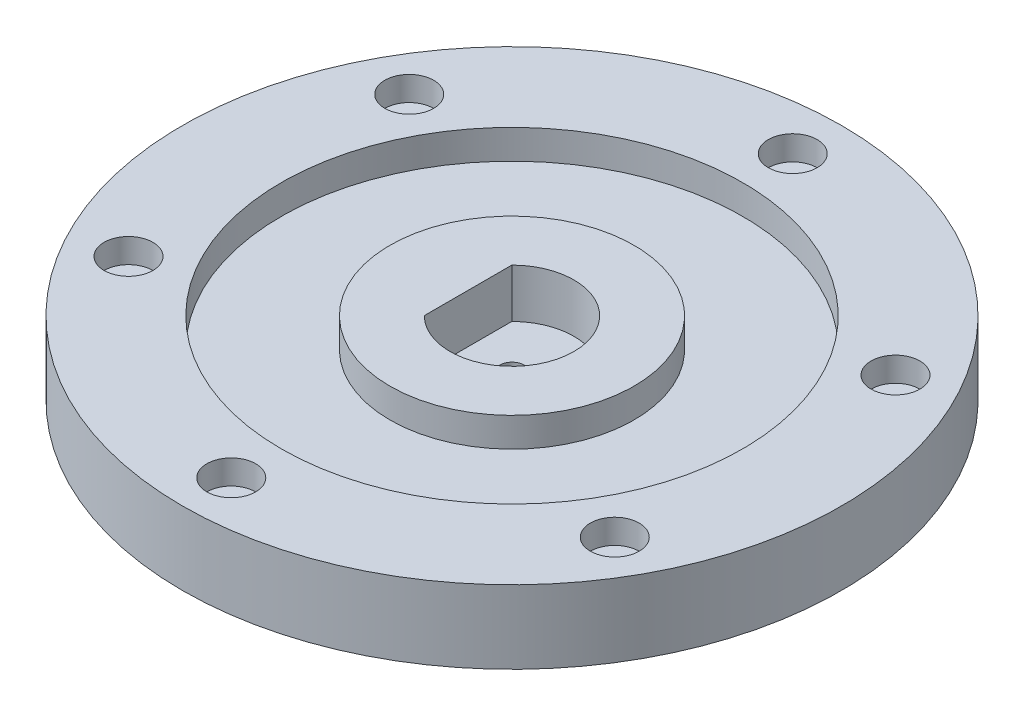
ISO-10303-21;
HEADER;
FILE_DESCRIPTION(('STEP AP214'),'2;1');
FILE_NAME('part.step','',(''),(''),'','','');
FILE_SCHEMA(('AUTOMOTIVE_DESIGN { 1 0 10303 214 1 1 1 1 }'));
ENDSEC;
DATA;
#1=APPLICATION_CONTEXT('core data for automotive mechanical design processes');
#2=APPLICATION_PROTOCOL_DEFINITION('international standard','automotive_design',2000,#1);
#3=PRODUCT_CONTEXT('',#1,'mechanical');
#4=PRODUCT('Part','Part','',(#3));
#5=PRODUCT_RELATED_PRODUCT_CATEGORY('part','',(#4));
#6=PRODUCT_DEFINITION_FORMATION('','',#4);
#7=PRODUCT_DEFINITION_CONTEXT('part definition',#1,'design');
#8=PRODUCT_DEFINITION('design','',#6,#7);
#9=PRODUCT_DEFINITION_SHAPE('','',#8);
#10=(LENGTH_UNIT() NAMED_UNIT(*) SI_UNIT(.MILLI.,.METRE.));
#11=(NAMED_UNIT(*) PLANE_ANGLE_UNIT() SI_UNIT($,.RADIAN.));
#12=(NAMED_UNIT(*) SI_UNIT($,.STERADIAN.) SOLID_ANGLE_UNIT());
#13=UNCERTAINTY_MEASURE_WITH_UNIT(LENGTH_MEASURE(1.E-05),#10,'distance_accuracy_value','');
#14=(GEOMETRIC_REPRESENTATION_CONTEXT(3) GLOBAL_UNCERTAINTY_ASSIGNED_CONTEXT((#13)) GLOBAL_UNIT_ASSIGNED_CONTEXT((#10,
#11,#12)) REPRESENTATION_CONTEXT('',''));
#15=CARTESIAN_POINT('',(0.,0.,0.));
#16=DIRECTION('',(0.,0.,1.));
#17=DIRECTION('',(1.,0.,0.));
#18=AXIS2_PLACEMENT_3D('',#15,#16,#17);
#19=CARTESIAN_POINT('',(-49.796460717604,0.,-28.7499999999978));
#20=DIRECTION('',(0.,1.,0.));
#21=DIRECTION('',(0.,0.,1.));
#22=AXIS2_PLACEMENT_3D('',#19,#20,#21);
#23=CYLINDRICAL_SURFACE('',#22,2.00000000000247);
#24=CARTESIAN_POINT('',(-49.796460717604,0.,-28.7499999999978));
#25=DIRECTION('',(0.,1.,0.));
#26=DIRECTION('',(0.,0.,1.));
#27=AXIS2_PLACEMENT_3D('',#24,#25,#26);
#28=CIRCLE('',#27,2.00000000000247);
#29=CARTESIAN_POINT('',(-49.796460717604,0.,-26.7499999999954));
#30=VERTEX_POINT('',#29);
#31=EDGE_CURVE('E105',#30,#30,#28,.T.);
#32=ORIENTED_EDGE('',*,*,#31,.F.);
#33=EDGE_LOOP('',(#32));
#34=FACE_BOUND('',#33,.T.);
#35=CARTESIAN_POINT('',(-49.796460717604,10.,-28.7499999999978));
#36=DIRECTION('',(0.,1.,0.));
#37=DIRECTION('',(0.,0.,1.));
#38=AXIS2_PLACEMENT_3D('',#35,#36,#37);
#39=CIRCLE('',#38,2.00000000000247);
#40=CARTESIAN_POINT('',(-49.796460717604,10.,-26.7499999999954));
#41=VERTEX_POINT('',#40);
#42=EDGE_CURVE('E40',#41,#41,#39,.F.);
#43=ORIENTED_EDGE('',*,*,#42,.F.);
#44=EDGE_LOOP('',(#43));
#45=FACE_BOUND('',#44,.T.);
#46=ADVANCED_FACE('F36',(#34,#45),#23,.F.);
#47=CARTESIAN_POINT('',(-49.7964607176015,0.,28.7500000000021));
#48=DIRECTION('',(0.,1.,0.));
#49=DIRECTION('',(0.,0.,1.));
#50=AXIS2_PLACEMENT_3D('',#47,#48,#49);
#51=CYLINDRICAL_SURFACE('',#50,2.00000000000465);
#52=CARTESIAN_POINT('',(-49.7964607176015,0.,28.7500000000021));
#53=DIRECTION('',(0.,1.,0.));
#54=DIRECTION('',(0.,0.,1.));
#55=AXIS2_PLACEMENT_3D('',#52,#53,#54);
#56=CIRCLE('',#55,2.00000000000465);
#57=CARTESIAN_POINT('',(-49.7964607176015,0.,30.7500000000068));
#58=VERTEX_POINT('',#57);
#59=EDGE_CURVE('E142',#58,#58,#56,.T.);
#60=ORIENTED_EDGE('',*,*,#59,.F.);
#61=EDGE_LOOP('',(#60));
#62=FACE_BOUND('',#61,.T.);
#63=CARTESIAN_POINT('',(-49.7964607176015,10.,28.7500000000021));
#64=DIRECTION('',(0.,1.,0.));
#65=DIRECTION('',(0.,0.,1.));
#66=AXIS2_PLACEMENT_3D('',#63,#64,#65);
#67=CIRCLE('',#66,2.00000000000465);
#68=CARTESIAN_POINT('',(-49.7964607176015,10.,30.7500000000068));
#69=VERTEX_POINT('',#68);
#70=EDGE_CURVE('E116',#69,#69,#67,.F.);
#71=ORIENTED_EDGE('',*,*,#70,.F.);
#72=EDGE_LOOP('',(#71));
#73=FACE_BOUND('',#72,.T.);
#74=ADVANCED_FACE('F166',(#62,#73),#51,.F.);
#75=CARTESIAN_POINT('',(4.8886614385545E-12,0.,57.5));
#76=DIRECTION('',(0.,1.,0.));
#77=DIRECTION('',(0.,0.,1.));
#78=AXIS2_PLACEMENT_3D('',#75,#76,#77);
#79=CYLINDRICAL_SURFACE('',#78,2.00000000000506);
#80=CARTESIAN_POINT('',(4.8886614385545E-12,0.,57.5));
#81=DIRECTION('',(0.,1.,0.));
#82=DIRECTION('',(0.,0.,1.));
#83=AXIS2_PLACEMENT_3D('',#80,#81,#82);
#84=CIRCLE('',#83,2.00000000000506);
#85=CARTESIAN_POINT('',(4.8886614385545E-12,0.,59.5000000000051));
#86=VERTEX_POINT('',#85);
#87=EDGE_CURVE('E139',#86,#86,#84,.T.);
#88=ORIENTED_EDGE('',*,*,#87,.F.);
#89=EDGE_LOOP('',(#88));
#90=FACE_BOUND('',#89,.T.);
#91=CARTESIAN_POINT('',(4.8886614385545E-12,10.,57.5));
#92=DIRECTION('',(0.,1.,0.));
#93=DIRECTION('',(0.,0.,1.));
#94=AXIS2_PLACEMENT_3D('',#91,#92,#93);
#95=CIRCLE('',#94,2.00000000000506);
#96=CARTESIAN_POINT('',(4.8886614385545E-12,10.,59.5000000000051));
#97=VERTEX_POINT('',#96);
#98=EDGE_CURVE('E114',#97,#97,#95,.F.);
#99=ORIENTED_EDGE('',*,*,#98,.F.);
#100=EDGE_LOOP('',(#99));
#101=FACE_BOUND('',#100,.T.);
#102=ADVANCED_FACE('F172',(#90,#101),#79,.F.);
#103=CARTESIAN_POINT('',(49.7964607176089,0.,28.7499999999979));
#104=DIRECTION('',(0.,1.,0.));
#105=DIRECTION('',(0.,0.,1.));
#106=AXIS2_PLACEMENT_3D('',#103,#104,#105);
#107=CYLINDRICAL_SURFACE('',#106,2.00000000000315);
#108=CARTESIAN_POINT('',(49.7964607176089,0.,28.7499999999979));
#109=DIRECTION('',(0.,1.,0.));
#110=DIRECTION('',(0.,0.,1.));
#111=AXIS2_PLACEMENT_3D('',#108,#109,#110);
#112=CIRCLE('',#111,2.00000000000315);
#113=CARTESIAN_POINT('',(49.7964607176089,0.,30.750000000001));
#114=VERTEX_POINT('',#113);
#115=EDGE_CURVE('E136',#114,#114,#112,.T.);
#116=ORIENTED_EDGE('',*,*,#115,.F.);
#117=EDGE_LOOP('',(#116));
#118=FACE_BOUND('',#117,.T.);
#119=CARTESIAN_POINT('',(49.7964607176089,10.,28.7499999999979));
#120=DIRECTION('',(0.,1.,0.));
#121=DIRECTION('',(0.,0.,1.));
#122=AXIS2_PLACEMENT_3D('',#119,#120,#121);
#123=CIRCLE('',#122,2.00000000000315);
#124=CARTESIAN_POINT('',(49.7964607176089,10.,30.750000000001));
#125=VERTEX_POINT('',#124);
#126=EDGE_CURVE('E110',#125,#125,#123,.F.);
#127=ORIENTED_EDGE('',*,*,#126,.F.);
#128=EDGE_LOOP('',(#127));
#129=FACE_BOUND('',#128,.T.);
#130=ADVANCED_FACE('F189',(#118,#129),#107,.F.);
#131=CARTESIAN_POINT('',(49.7964607176064,0.,-28.7500000000021));
#132=DIRECTION('',(0.,1.,0.));
#133=DIRECTION('',(0.,0.,1.));
#134=AXIS2_PLACEMENT_3D('',#131,#132,#133);
#135=CYLINDRICAL_SURFACE('',#134,2.0000000000007);
#136=CARTESIAN_POINT('',(49.7964607176064,0.,-28.7500000000021));
#137=DIRECTION('',(0.,1.,0.));
#138=DIRECTION('',(0.,0.,1.));
#139=AXIS2_PLACEMENT_3D('',#136,#137,#138);
#140=CIRCLE('',#139,2.0000000000007);
#141=CARTESIAN_POINT('',(49.7964607176064,0.,-26.7500000000014));
#142=VERTEX_POINT('',#141);
#143=EDGE_CURVE('E132',#142,#142,#140,.T.);
#144=ORIENTED_EDGE('',*,*,#143,.F.);
#145=EDGE_LOOP('',(#144));
#146=FACE_BOUND('',#145,.T.);
#147=CARTESIAN_POINT('',(49.7964607176064,10.,-28.7500000000021));
#148=DIRECTION('',(0.,1.,0.));
#149=DIRECTION('',(0.,0.,1.));
#150=AXIS2_PLACEMENT_3D('',#147,#148,#149);
#151=CIRCLE('',#150,2.0000000000007);
#152=CARTESIAN_POINT('',(49.7964607176064,10.,-26.7500000000014));
#153=VERTEX_POINT('',#152);
#154=EDGE_CURVE('E107',#153,#153,#151,.F.);
#155=ORIENTED_EDGE('',*,*,#154,.F.);
#156=EDGE_LOOP('',(#155));
#157=FACE_BOUND('',#156,.T.);
#158=ADVANCED_FACE('F181',(#146,#157),#135,.F.);
#159=CARTESIAN_POINT('',(0.,0.,-57.5));
#160=DIRECTION('',(0.,1.,0.));
#161=DIRECTION('',(0.,0.,1.));
#162=AXIS2_PLACEMENT_3D('',#159,#160,#161);
#163=CYLINDRICAL_SURFACE('',#162,2.);
#164=CARTESIAN_POINT('',(0.,0.,-57.5));
#165=DIRECTION('',(0.,1.,0.));
#166=DIRECTION('',(0.,0.,1.));
#167=AXIS2_PLACEMENT_3D('',#164,#165,#166);
#168=CIRCLE('',#167,2.);
#169=CARTESIAN_POINT('',(0.,0.,-55.5));
#170=VERTEX_POINT('',#169);
#171=EDGE_CURVE('E135',#170,#170,#168,.T.);
#172=ORIENTED_EDGE('',*,*,#171,.F.);
#173=EDGE_LOOP('',(#172));
#174=FACE_BOUND('',#173,.T.);
#175=CARTESIAN_POINT('',(0.,10.,-57.5));
#176=DIRECTION('',(0.,1.,0.));
#177=DIRECTION('',(0.,0.,1.));
#178=AXIS2_PLACEMENT_3D('',#175,#176,#177);
#179=CIRCLE('',#178,2.);
#180=CARTESIAN_POINT('',(0.,10.,-55.5));
#181=VERTEX_POINT('',#180);
#182=EDGE_CURVE('E102',#181,#181,#179,.F.);
#183=ORIENTED_EDGE('',*,*,#182,.F.);
#184=EDGE_LOOP('',(#183));
#185=FACE_BOUND('',#184,.T.);
#186=ADVANCED_FACE('F179',(#174,#185),#163,.F.);
#187=CARTESIAN_POINT('',(0.,15.,0.));
#188=DIRECTION('',(0.,-1.,0.));
#189=DIRECTION('',(0.,0.,-1.));
#190=AXIS2_PLACEMENT_3D('',#187,#188,#189);
#191=CYLINDRICAL_SURFACE('',#190,67.5);
#192=CARTESIAN_POINT('',(0.,15.,0.));
#193=DIRECTION('',(0.,1.,0.));
#194=DIRECTION('',(0.,0.,1.));
#195=AXIS2_PLACEMENT_3D('',#192,#193,#194);
#196=CIRCLE('',#195,67.5);
#197=CARTESIAN_POINT('',(0.,15.,67.5));
#198=VERTEX_POINT('',#197);
#199=EDGE_CURVE('E11',#198,#198,#196,.T.);
#200=ORIENTED_EDGE('',*,*,#199,.F.);
#201=EDGE_LOOP('',(#200));
#202=FACE_BOUND('',#201,.T.);
#203=CARTESIAN_POINT('',(0.,0.,0.));
#204=DIRECTION('',(0.,1.,0.));
#205=DIRECTION('',(0.,0.,1.));
#206=AXIS2_PLACEMENT_3D('',#203,#204,#205);
#207=CIRCLE('',#206,67.5);
#208=CARTESIAN_POINT('',(0.,0.,67.5));
#209=VERTEX_POINT('',#208);
#210=EDGE_CURVE('E45',#209,#209,#207,.T.);
#211=ORIENTED_EDGE('',*,*,#210,.T.);
#212=EDGE_LOOP('',(#211));
#213=FACE_BOUND('',#212,.T.);
#214=ADVANCED_FACE('F38',(#202,#213),#191,.T.);
#215=CARTESIAN_POINT('',(0.,15.,0.));
#216=DIRECTION('',(0.,1.,0.));
#217=DIRECTION('',(0.,0.,1.));
#218=AXIS2_PLACEMENT_3D('',#215,#216,#217);
#219=PLANE('',#218);
#220=CARTESIAN_POINT('',(49.7964607176064,15.,-28.7500000000021));
#221=DIRECTION('',(0.,1.,0.));
#222=DIRECTION('',(0.,0.,1.));
#223=AXIS2_PLACEMENT_3D('',#220,#221,#222);
#224=CIRCLE('',#223,5.0000000000007);
#225=CARTESIAN_POINT('',(49.7964607176064,15.,-23.7500000000014));
#226=VERTEX_POINT('',#225);
#227=EDGE_CURVE('E278',#226,#226,#224,.T.);
#228=ORIENTED_EDGE('',*,*,#227,.F.);
#229=EDGE_LOOP('',(#228));
#230=FACE_BOUND('',#229,.T.);
#231=CARTESIAN_POINT('',(49.7964607176089,15.,28.7499999999979));
#232=DIRECTION('',(0.,1.,0.));
#233=DIRECTION('',(0.,0.,1.));
#234=AXIS2_PLACEMENT_3D('',#231,#232,#233);
#235=CIRCLE('',#234,5.00000000000315);
#236=CARTESIAN_POINT('',(49.7964607176089,15.,33.750000000001));
#237=VERTEX_POINT('',#236);
#238=EDGE_CURVE('E272',#237,#237,#235,.T.);
#239=ORIENTED_EDGE('',*,*,#238,.F.);
#240=EDGE_LOOP('',(#239));
#241=FACE_BOUND('',#240,.T.);
#242=CARTESIAN_POINT('',(4.8886614385545E-12,15.,57.5));
#243=DIRECTION('',(0.,1.,0.));
#244=DIRECTION('',(0.,0.,1.));
#245=AXIS2_PLACEMENT_3D('',#242,#243,#244);
#246=CIRCLE('',#245,5.00000000000506);
#247=CARTESIAN_POINT('',(4.8886614385545E-12,15.,62.5000000000051));
#248=VERTEX_POINT('',#247);
#249=EDGE_CURVE('E267',#248,#248,#246,.T.);
#250=ORIENTED_EDGE('',*,*,#249,.F.);
#251=EDGE_LOOP('',(#250));
#252=FACE_BOUND('',#251,.T.);
#253=CARTESIAN_POINT('',(-49.7964607176015,15.,28.7500000000021));
#254=DIRECTION('',(0.,1.,0.));
#255=DIRECTION('',(0.,0.,1.));
#256=AXIS2_PLACEMENT_3D('',#253,#254,#255);
#257=CIRCLE('',#256,5.00000000000465);
#258=CARTESIAN_POINT('',(-49.7964607176015,15.,33.7500000000068));
#259=VERTEX_POINT('',#258);
#260=EDGE_CURVE('E256',#259,#259,#257,.T.);
#261=ORIENTED_EDGE('',*,*,#260,.F.);
#262=EDGE_LOOP('',(#261));
#263=FACE_BOUND('',#262,.T.);
#264=CARTESIAN_POINT('',(-49.796460717604,15.,-28.7499999999978));
#265=DIRECTION('',(0.,1.,0.));
#266=DIRECTION('',(0.,0.,1.));
#267=AXIS2_PLACEMENT_3D('',#264,#265,#266);
#268=CIRCLE('',#267,5.00000000000247);
#269=CARTESIAN_POINT('',(-49.796460717604,15.,-23.7499999999954));
#270=VERTEX_POINT('',#269);
#271=EDGE_CURVE('E257',#270,#270,#268,.T.);
#272=ORIENTED_EDGE('',*,*,#271,.F.);
#273=EDGE_LOOP('',(#272));
#274=FACE_BOUND('',#273,.T.);
#275=CARTESIAN_POINT('',(0.,15.,-57.5));
#276=DIRECTION('',(0.,1.,0.));
#277=DIRECTION('',(0.,0.,1.));
#278=AXIS2_PLACEMENT_3D('',#275,#276,#277);
#279=CIRCLE('',#278,5.);
#280=CARTESIAN_POINT('',(0.,15.,-52.5));
#281=VERTEX_POINT('',#280);
#282=EDGE_CURVE('E121',#281,#281,#279,.T.);
#283=ORIENTED_EDGE('',*,*,#282,.F.);
#284=EDGE_LOOP('',(#283));
#285=FACE_BOUND('',#284,.T.);
#286=CARTESIAN_POINT('',(0.,15.,0.));
#287=DIRECTION('',(0.,1.,0.));
#288=DIRECTION('',(0.,0.,1.));
#289=AXIS2_PLACEMENT_3D('',#286,#287,#288);
#290=CIRCLE('',#289,47.25);
#291=CARTESIAN_POINT('',(0.,15.,47.25));
#292=VERTEX_POINT('',#291);
#293=EDGE_CURVE('E92',#292,#292,#290,.T.);
#294=ORIENTED_EDGE('',*,*,#293,.F.);
#295=EDGE_LOOP('',(#294));
#296=FACE_BOUND('',#295,.T.);
#297=ORIENTED_EDGE('',*,*,#199,.T.);
#298=EDGE_LOOP('',(#297));
#299=FACE_BOUND('',#298,.T.);
#300=ADVANCED_FACE('F187',(#230,#241,#252,#263,#274,#285,#296,#299),#219,.T.);
#301=CARTESIAN_POINT('',(0.,0.,0.));
#302=DIRECTION('',(0.,1.,0.));
#303=DIRECTION('',(0.,0.,1.));
#304=AXIS2_PLACEMENT_3D('',#301,#302,#303);
#305=PLANE('',#304);
#306=CARTESIAN_POINT('',(-45.,0.,45.));
#307=DIRECTION('',(0.,-1.,0.));
#308=DIRECTION('',(0.,0.,-1.));
#309=AXIS2_PLACEMENT_3D('',#306,#307,#308);
#310=CIRCLE('',#309,2.);
#311=CARTESIAN_POINT('',(-45.,0.,43.));
#312=VERTEX_POINT('',#311);
#313=EDGE_CURVE('E308',#312,#312,#310,.T.);
#314=ORIENTED_EDGE('',*,*,#313,.F.);
#315=EDGE_LOOP('',(#314));
#316=FACE_BOUND('',#315,.T.);
#317=CARTESIAN_POINT('',(25.,0.,45.));
#318=DIRECTION('',(0.,-1.,0.));
#319=DIRECTION('',(0.,0.,-1.));
#320=AXIS2_PLACEMENT_3D('',#317,#318,#319);
#321=CIRCLE('',#320,2.00000000000001);
#322=CARTESIAN_POINT('',(25.,0.,43.));
#323=VERTEX_POINT('',#322);
#324=EDGE_CURVE('E302',#323,#323,#321,.T.);
#325=ORIENTED_EDGE('',*,*,#324,.F.);
#326=EDGE_LOOP('',(#325));
#327=FACE_BOUND('',#326,.T.);
#328=CARTESIAN_POINT('',(45.,0.,45.));
#329=DIRECTION('',(0.,-1.,0.));
#330=DIRECTION('',(0.,0.,-1.));
#331=AXIS2_PLACEMENT_3D('',#328,#329,#330);
#332=CIRCLE('',#331,2.);
#333=CARTESIAN_POINT('',(45.,0.,43.));
#334=VERTEX_POINT('',#333);
#335=EDGE_CURVE('E296',#334,#334,#332,.T.);
#336=ORIENTED_EDGE('',*,*,#335,.F.);
#337=EDGE_LOOP('',(#336));
#338=FACE_BOUND('',#337,.T.);
#339=CARTESIAN_POINT('',(45.,0.,-45.));
#340=DIRECTION('',(0.,-1.,0.));
#341=DIRECTION('',(0.,0.,1.));
#342=AXIS2_PLACEMENT_3D('',#339,#340,#341);
#343=CIRCLE('',#342,2.);
#344=CARTESIAN_POINT('',(45.,0.,-43.));
#345=VERTEX_POINT('',#344);
#346=EDGE_CURVE('E289',#345,#345,#343,.T.);
#347=ORIENTED_EDGE('',*,*,#346,.F.);
#348=EDGE_LOOP('',(#347));
#349=FACE_BOUND('',#348,.T.);
#350=CARTESIAN_POINT('',(25.,0.,-45.));
#351=DIRECTION('',(0.,-1.,0.));
#352=DIRECTION('',(0.,0.,1.));
#353=AXIS2_PLACEMENT_3D('',#350,#351,#352);
#354=CIRCLE('',#353,2.00000000000001);
#355=CARTESIAN_POINT('',(25.,0.,-43.));
#356=VERTEX_POINT('',#355);
#357=EDGE_CURVE('E325',#356,#356,#354,.T.);
#358=ORIENTED_EDGE('',*,*,#357,.F.);
#359=EDGE_LOOP('',(#358));
#360=FACE_BOUND('',#359,.T.);
#361=CARTESIAN_POINT('',(-25.,0.,-45.));
#362=DIRECTION('',(0.,-1.,0.));
#363=DIRECTION('',(0.,0.,1.));
#364=AXIS2_PLACEMENT_3D('',#361,#362,#363);
#365=CIRCLE('',#364,2.);
#366=CARTESIAN_POINT('',(-25.,0.,-43.));
#367=VERTEX_POINT('',#366);
#368=EDGE_CURVE('E319',#367,#367,#365,.T.);
#369=ORIENTED_EDGE('',*,*,#368,.F.);
#370=EDGE_LOOP('',(#369));
#371=FACE_BOUND('',#370,.T.);
#372=CARTESIAN_POINT('',(-45.,0.,-45.));
#373=DIRECTION('',(0.,-1.,0.));
#374=DIRECTION('',(0.,0.,1.));
#375=AXIS2_PLACEMENT_3D('',#372,#373,#374);
#376=CIRCLE('',#375,2.);
#377=CARTESIAN_POINT('',(-45.,0.,-43.));
#378=VERTEX_POINT('',#377);
#379=EDGE_CURVE('E313',#378,#378,#376,.T.);
#380=ORIENTED_EDGE('',*,*,#379,.F.);
#381=EDGE_LOOP('',(#380));
#382=FACE_BOUND('',#381,.T.);
#383=CARTESIAN_POINT('',(-25.,0.,45.));
#384=DIRECTION('',(0.,-1.,0.));
#385=DIRECTION('',(0.,0.,-1.));
#386=AXIS2_PLACEMENT_3D('',#383,#384,#385);
#387=CIRCLE('',#386,2.);
#388=CARTESIAN_POINT('',(-25.,0.,43.));
#389=VERTEX_POINT('',#388);
#390=EDGE_CURVE('E283',#389,#389,#387,.T.);
#391=ORIENTED_EDGE('',*,*,#390,.F.);
#392=EDGE_LOOP('',(#391));
#393=FACE_BOUND('',#392,.T.);
#394=ORIENTED_EDGE('',*,*,#143,.T.);
#395=EDGE_LOOP('',(#394));
#396=FACE_BOUND('',#395,.T.);
#397=ORIENTED_EDGE('',*,*,#115,.T.);
#398=EDGE_LOOP('',(#397));
#399=FACE_BOUND('',#398,.T.);
#400=ORIENTED_EDGE('',*,*,#87,.T.);
#401=EDGE_LOOP('',(#400));
#402=FACE_BOUND('',#401,.T.);
#403=ORIENTED_EDGE('',*,*,#59,.T.);
#404=EDGE_LOOP('',(#403));
#405=FACE_BOUND('',#404,.T.);
#406=ORIENTED_EDGE('',*,*,#31,.T.);
#407=EDGE_LOOP('',(#406));
#408=FACE_BOUND('',#407,.T.);
#409=ORIENTED_EDGE('',*,*,#171,.T.);
#410=EDGE_LOOP('',(#409));
#411=FACE_BOUND('',#410,.T.);
#412=CARTESIAN_POINT('',(0.,0.,0.));
#413=DIRECTION('',(0.,1.,0.));
#414=DIRECTION('',(0.,0.,1.));
#415=AXIS2_PLACEMENT_3D('',#412,#413,#414);
#416=CIRCLE('',#415,2.5);
#417=CARTESIAN_POINT('',(0.,0.,2.5));
#418=VERTEX_POINT('',#417);
#419=EDGE_CURVE('E79',#418,#418,#416,.T.);
#420=ORIENTED_EDGE('',*,*,#419,.T.);
#421=EDGE_LOOP('',(#420));
#422=FACE_BOUND('',#421,.T.);
#423=ORIENTED_EDGE('',*,*,#210,.F.);
#424=EDGE_LOOP('',(#423));
#425=FACE_BOUND('',#424,.T.);
#426=ADVANCED_FACE('F340',(#316,#327,#338,#349,#360,#371,#382,#393,#396,#399,#402,#405,#408,
#411,#422,#425),#305,.F.);
#427=CARTESIAN_POINT('',(0.,9.,0.));
#428=DIRECTION('',(0.,1.,0.));
#429=DIRECTION('',(0.,0.,1.));
#430=AXIS2_PLACEMENT_3D('',#427,#428,#429);
#431=CYLINDRICAL_SURFACE('',#430,47.25);
#432=CARTESIAN_POINT('',(0.,9.,0.));
#433=DIRECTION('',(0.,1.,0.));
#434=DIRECTION('',(0.,0.,1.));
#435=AXIS2_PLACEMENT_3D('',#432,#433,#434);
#436=CIRCLE('',#435,47.25);
#437=CARTESIAN_POINT('',(0.,9.,47.25));
#438=VERTEX_POINT('',#437);
#439=EDGE_CURVE('E95',#438,#438,#436,.T.);
#440=ORIENTED_EDGE('',*,*,#439,.F.);
#441=EDGE_LOOP('',(#440));
#442=FACE_BOUND('',#441,.T.);
#443=ORIENTED_EDGE('',*,*,#293,.T.);
#444=EDGE_LOOP('',(#443));
#445=FACE_BOUND('',#444,.T.);
#446=ADVANCED_FACE('F343',(#442,#445),#431,.F.);
#447=CARTESIAN_POINT('',(0.,9.,0.));
#448=DIRECTION('',(0.,1.,0.));
#449=DIRECTION('',(0.,0.,1.));
#450=AXIS2_PLACEMENT_3D('',#447,#448,#449);
#451=PLANE('',#450);
#452=CARTESIAN_POINT('',(0.,9.,0.));
#453=DIRECTION('',(0.,1.,0.));
#454=DIRECTION('',(0.,0.,1.));
#455=AXIS2_PLACEMENT_3D('',#452,#453,#454);
#456=CIRCLE('',#455,25.);
#457=CARTESIAN_POINT('',(0.,9.,25.));
#458=VERTEX_POINT('',#457);
#459=EDGE_CURVE('E89',#458,#458,#456,.T.);
#460=ORIENTED_EDGE('',*,*,#459,.F.);
#461=EDGE_LOOP('',(#460));
#462=FACE_BOUND('',#461,.T.);
#463=ORIENTED_EDGE('',*,*,#439,.T.);
#464=EDGE_LOOP('',(#463));
#465=FACE_BOUND('',#464,.T.);
#466=ADVANCED_FACE('F640',(#462,#465),#451,.T.);
#467=CARTESIAN_POINT('',(0.,9.,0.));
#468=DIRECTION('',(0.,1.,0.));
#469=DIRECTION('',(0.,0.,1.));
#470=AXIS2_PLACEMENT_3D('',#467,#468,#469);
#471=CYLINDRICAL_SURFACE('',#470,25.);
#472=ORIENTED_EDGE('',*,*,#459,.T.);
#473=EDGE_LOOP('',(#472));
#474=FACE_BOUND('',#473,.T.);
#475=CARTESIAN_POINT('',(0.,15.,0.));
#476=DIRECTION('',(0.,1.,0.));
#477=DIRECTION('',(0.,0.,1.));
#478=AXIS2_PLACEMENT_3D('',#475,#476,#477);
#479=CIRCLE('',#478,25.);
#480=CARTESIAN_POINT('',(0.,15.,25.));
#481=VERTEX_POINT('',#480);
#482=EDGE_CURVE('E69',#481,#481,#479,.T.);
#483=ORIENTED_EDGE('',*,*,#482,.F.);
#484=EDGE_LOOP('',(#483));
#485=FACE_BOUND('',#484,.T.);
#486=ADVANCED_FACE('F634',(#474,#485),#471,.T.);
#487=CARTESIAN_POINT('',(0.,15.,0.));
#488=DIRECTION('',(0.,1.,0.));
#489=DIRECTION('',(0.,0.,1.));
#490=AXIS2_PLACEMENT_3D('',#487,#488,#489);
#491=CIRCLE('',#490,12.7);
#492=CARTESIAN_POINT('',(-9.,15.,8.96046873773911));
#493=VERTEX_POINT('',#492);
#494=CARTESIAN_POINT('',(-9.,15.,-8.96046873773911));
#495=VERTEX_POINT('',#494);
#496=EDGE_CURVE('E53',#493,#495,#491,.T.);
#497=ORIENTED_EDGE('',*,*,#496,.F.);
#498=DIRECTION('',(0.,0.,1.));
#499=VECTOR('',#498,1.);
#500=CARTESIAN_POINT('',(-9.,15.,-8.96046873773911));
#501=LINE('',#500,#499);
#502=EDGE_CURVE('E73',#495,#493,#501,.T.);
#503=ORIENTED_EDGE('',*,*,#502,.F.);
#504=EDGE_LOOP('',(#497,#503));
#505=FACE_BOUND('',#504,.T.);
#506=ORIENTED_EDGE('',*,*,#482,.T.);
#507=EDGE_LOOP('',(#506));
#508=FACE_BOUND('',#507,.T.);
#509=ADVANCED_FACE('F77',(#505,#508),#219,.T.);
#510=CARTESIAN_POINT('',(0.,5.,0.));
#511=DIRECTION('',(0.,1.,0.));
#512=DIRECTION('',(0.,0.,1.));
#513=AXIS2_PLACEMENT_3D('',#510,#511,#512);
#514=CYLINDRICAL_SURFACE('',#513,12.7);
#515=ORIENTED_EDGE('',*,*,#496,.T.);
#516=DIRECTION('',(0.,1.,0.));
#517=VECTOR('',#516,1.);
#518=CARTESIAN_POINT('',(-9.,5.,-8.96046873773911));
#519=LINE('',#518,#517);
#520=CARTESIAN_POINT('',(-9.,5.,-8.96046873773911));
#521=VERTEX_POINT('',#520);
#522=EDGE_CURVE('E70',#521,#495,#519,.T.);
#523=ORIENTED_EDGE('',*,*,#522,.F.);
#524=CARTESIAN_POINT('',(0.,5.,0.));
#525=DIRECTION('',(0.,1.,0.));
#526=DIRECTION('',(0.,0.,1.));
#527=AXIS2_PLACEMENT_3D('',#524,#525,#526);
#528=CIRCLE('',#527,12.7);
#529=CARTESIAN_POINT('',(-9.,5.,8.96046873773911));
#530=VERTEX_POINT('',#529);
#531=EDGE_CURVE('E67',#530,#521,#528,.T.);
#532=ORIENTED_EDGE('',*,*,#531,.F.);
#533=DIRECTION('',(0.,1.,0.));
#534=VECTOR('',#533,1.);
#535=CARTESIAN_POINT('',(-9.,5.,8.96046873773911));
#536=LINE('',#535,#534);
#537=EDGE_CURVE('E61',#530,#493,#536,.T.);
#538=ORIENTED_EDGE('',*,*,#537,.T.);
#539=EDGE_LOOP('',(#515,#523,#532,#538));
#540=FACE_BOUND('',#539,.T.);
#541=ADVANCED_FACE('F65',(#540),#514,.F.);
#542=CARTESIAN_POINT('',(-9.,5.,-8.96046873773911));
#543=DIRECTION('',(-1.,0.,0.));
#544=DIRECTION('',(0.,0.,1.));
#545=AXIS2_PLACEMENT_3D('',#542,#543,#544);
#546=PLANE('',#545);
#547=ORIENTED_EDGE('',*,*,#502,.T.);
#548=ORIENTED_EDGE('',*,*,#537,.F.);
#549=DIRECTION('',(0.,0.,1.));
#550=VECTOR('',#549,1.);
#551=CARTESIAN_POINT('',(-9.,5.,-8.96046873773911));
#552=LINE('',#551,#550);
#553=EDGE_CURVE('E85',#521,#530,#552,.T.);
#554=ORIENTED_EDGE('',*,*,#553,.F.);
#555=ORIENTED_EDGE('',*,*,#522,.T.);
#556=EDGE_LOOP('',(#547,#548,#554,#555));
#557=FACE_BOUND('',#556,.T.);
#558=ADVANCED_FACE('F74',(#557),#546,.F.);
#559=CARTESIAN_POINT('',(0.,5.,0.));
#560=DIRECTION('',(0.,1.,0.));
#561=DIRECTION('',(0.,0.,1.));
#562=AXIS2_PLACEMENT_3D('',#559,#560,#561);
#563=PLANE('',#562);
#564=CARTESIAN_POINT('',(0.,5.,0.));
#565=DIRECTION('',(0.,1.,0.));
#566=DIRECTION('',(0.,0.,1.));
#567=AXIS2_PLACEMENT_3D('',#564,#565,#566);
#568=CIRCLE('',#567,2.5);
#569=CARTESIAN_POINT('',(0.,5.,2.5));
#570=VERTEX_POINT('',#569);
#571=EDGE_CURVE('E82',#570,#570,#568,.T.);
#572=ORIENTED_EDGE('',*,*,#571,.F.);
#573=EDGE_LOOP('',(#572));
#574=FACE_BOUND('',#573,.T.);
#575=ORIENTED_EDGE('',*,*,#531,.T.);
#576=ORIENTED_EDGE('',*,*,#553,.T.);
#577=EDGE_LOOP('',(#575,#576));
#578=FACE_BOUND('',#577,.T.);
#579=ADVANCED_FACE('F151',(#574,#578),#563,.T.);
#580=CARTESIAN_POINT('',(0.,-5.,0.));
#581=DIRECTION('',(0.,1.,0.));
#582=DIRECTION('',(0.,0.,1.));
#583=AXIS2_PLACEMENT_3D('',#580,#581,#582);
#584=CYLINDRICAL_SURFACE('',#583,2.5);
#585=ORIENTED_EDGE('',*,*,#571,.T.);
#586=EDGE_LOOP('',(#585));
#587=FACE_BOUND('',#586,.T.);
#588=ORIENTED_EDGE('',*,*,#419,.F.);
#589=EDGE_LOOP('',(#588));
#590=FACE_BOUND('',#589,.T.);
#591=ADVANCED_FACE('F153',(#587,#590),#584,.F.);
#592=CARTESIAN_POINT('',(0.,10.,-57.5));
#593=DIRECTION('',(0.,1.,0.));
#594=DIRECTION('',(0.,0.,1.));
#595=AXIS2_PLACEMENT_3D('',#592,#593,#594);
#596=PLANE('',#595);
#597=CARTESIAN_POINT('',(0.,10.,-57.5));
#598=DIRECTION('',(0.,1.,0.));
#599=DIRECTION('',(0.,0.,1.));
#600=AXIS2_PLACEMENT_3D('',#597,#598,#599);
#601=CIRCLE('',#600,5.);
#602=CARTESIAN_POINT('',(0.,10.,-52.5));
#603=VERTEX_POINT('',#602);
#604=EDGE_CURVE('E106',#603,#603,#601,.T.);
#605=ORIENTED_EDGE('',*,*,#604,.T.);
#606=EDGE_LOOP('',(#605));
#607=FACE_BOUND('',#606,.T.);
#608=ORIENTED_EDGE('',*,*,#182,.T.);
#609=EDGE_LOOP('',(#608));
#610=FACE_BOUND('',#609,.T.);
#611=ADVANCED_FACE('F160',(#607,#610),#596,.T.);
#612=CARTESIAN_POINT('',(0.,10.,-57.5));
#613=DIRECTION('',(0.,1.,0.));
#614=DIRECTION('',(0.,0.,1.));
#615=AXIS2_PLACEMENT_3D('',#612,#613,#614);
#616=CYLINDRICAL_SURFACE('',#615,5.);
#617=ORIENTED_EDGE('',*,*,#604,.F.);
#618=EDGE_LOOP('',(#617));
#619=FACE_BOUND('',#618,.T.);
#620=ORIENTED_EDGE('',*,*,#282,.T.);
#621=EDGE_LOOP('',(#620));
#622=FACE_BOUND('',#621,.T.);
#623=ADVANCED_FACE('F197',(#619,#622),#616,.F.);
#624=CARTESIAN_POINT('',(49.7964607176064,10.,-28.7500000000021));
#625=DIRECTION('',(0.,1.,0.));
#626=DIRECTION('',(0.,0.,1.));
#627=AXIS2_PLACEMENT_3D('',#624,#625,#626);
#628=PLANE('',#627);
#629=CARTESIAN_POINT('',(49.7964607176064,10.,-28.7500000000021));
#630=DIRECTION('',(0.,1.,0.));
#631=DIRECTION('',(0.,0.,1.));
#632=AXIS2_PLACEMENT_3D('',#629,#630,#631);
#633=CIRCLE('',#632,5.0000000000007);
#634=CARTESIAN_POINT('',(49.7964607176064,10.,-23.7500000000014));
#635=VERTEX_POINT('',#634);
#636=EDGE_CURVE('E111',#635,#635,#633,.T.);
#637=ORIENTED_EDGE('',*,*,#636,.T.);
#638=EDGE_LOOP('',(#637));
#639=FACE_BOUND('',#638,.T.);
#640=ORIENTED_EDGE('',*,*,#154,.T.);
#641=EDGE_LOOP('',(#640));
#642=FACE_BOUND('',#641,.T.);
#643=ADVANCED_FACE('F203',(#639,#642),#628,.T.);
#644=CARTESIAN_POINT('',(49.7964607176064,10.,-28.7500000000021));
#645=DIRECTION('',(0.,1.,0.));
#646=DIRECTION('',(0.,0.,1.));
#647=AXIS2_PLACEMENT_3D('',#644,#645,#646);
#648=CYLINDRICAL_SURFACE('',#647,5.0000000000007);
#649=ORIENTED_EDGE('',*,*,#636,.F.);
#650=EDGE_LOOP('',(#649));
#651=FACE_BOUND('',#650,.T.);
#652=ORIENTED_EDGE('',*,*,#227,.T.);
#653=EDGE_LOOP('',(#652));
#654=FACE_BOUND('',#653,.T.);
#655=ADVANCED_FACE('F370',(#651,#654),#648,.F.);
#656=CARTESIAN_POINT('',(49.7964607176089,10.,28.7499999999979));
#657=DIRECTION('',(0.,1.,0.));
#658=DIRECTION('',(0.,0.,1.));
#659=AXIS2_PLACEMENT_3D('',#656,#657,#658);
#660=PLANE('',#659);
#661=CARTESIAN_POINT('',(49.7964607176089,10.,28.7499999999979));
#662=DIRECTION('',(0.,1.,0.));
#663=DIRECTION('',(0.,0.,1.));
#664=AXIS2_PLACEMENT_3D('',#661,#662,#663);
#665=CIRCLE('',#664,5.00000000000315);
#666=CARTESIAN_POINT('',(49.7964607176089,10.,33.750000000001));
#667=VERTEX_POINT('',#666);
#668=EDGE_CURVE('E275',#667,#667,#665,.T.);
#669=ORIENTED_EDGE('',*,*,#668,.T.);
#670=EDGE_LOOP('',(#669));
#671=FACE_BOUND('',#670,.T.);
#672=ORIENTED_EDGE('',*,*,#126,.T.);
#673=EDGE_LOOP('',(#672));
#674=FACE_BOUND('',#673,.T.);
#675=ADVANCED_FACE('F233',(#671,#674),#660,.T.);
#676=CARTESIAN_POINT('',(49.7964607176089,10.,28.7499999999979));
#677=DIRECTION('',(0.,1.,0.));
#678=DIRECTION('',(0.,0.,1.));
#679=AXIS2_PLACEMENT_3D('',#676,#677,#678);
#680=CYLINDRICAL_SURFACE('',#679,5.00000000000315);
#681=ORIENTED_EDGE('',*,*,#668,.F.);
#682=EDGE_LOOP('',(#681));
#683=FACE_BOUND('',#682,.T.);
#684=ORIENTED_EDGE('',*,*,#238,.T.);
#685=EDGE_LOOP('',(#684));
#686=FACE_BOUND('',#685,.T.);
#687=ADVANCED_FACE('F223',(#683,#686),#680,.F.);
#688=CARTESIAN_POINT('',(4.8886614385545E-12,10.,57.5));
#689=DIRECTION('',(0.,1.,0.));
#690=DIRECTION('',(0.,0.,1.));
#691=AXIS2_PLACEMENT_3D('',#688,#689,#690);
#692=PLANE('',#691);
#693=CARTESIAN_POINT('',(4.8886614385545E-12,10.,57.5));
#694=DIRECTION('',(0.,1.,0.));
#695=DIRECTION('',(0.,0.,1.));
#696=AXIS2_PLACEMENT_3D('',#693,#694,#695);
#697=CIRCLE('',#696,5.00000000000506);
#698=CARTESIAN_POINT('',(4.8886614385545E-12,10.,62.5000000000051));
#699=VERTEX_POINT('',#698);
#700=EDGE_CURVE('E270',#699,#699,#697,.T.);
#701=ORIENTED_EDGE('',*,*,#700,.T.);
#702=EDGE_LOOP('',(#701));
#703=FACE_BOUND('',#702,.T.);
#704=ORIENTED_EDGE('',*,*,#98,.T.);
#705=EDGE_LOOP('',(#704));
#706=FACE_BOUND('',#705,.T.);
#707=ADVANCED_FACE('F220',(#703,#706),#692,.T.);
#708=CARTESIAN_POINT('',(4.8886614385545E-12,10.,57.5));
#709=DIRECTION('',(0.,1.,0.));
#710=DIRECTION('',(0.,0.,1.));
#711=AXIS2_PLACEMENT_3D('',#708,#709,#710);
#712=CYLINDRICAL_SURFACE('',#711,5.00000000000506);
#713=ORIENTED_EDGE('',*,*,#700,.F.);
#714=EDGE_LOOP('',(#713));
#715=FACE_BOUND('',#714,.T.);
#716=ORIENTED_EDGE('',*,*,#249,.T.);
#717=EDGE_LOOP('',(#716));
#718=FACE_BOUND('',#717,.T.);
#719=ADVANCED_FACE('F222',(#715,#718),#712,.F.);
#720=CARTESIAN_POINT('',(-49.7964607176015,10.,28.7500000000021));
#721=DIRECTION('',(0.,1.,0.));
#722=DIRECTION('',(0.,0.,1.));
#723=AXIS2_PLACEMENT_3D('',#720,#721,#722);
#724=PLANE('',#723);
#725=CARTESIAN_POINT('',(-49.7964607176015,10.,28.7500000000021));
#726=DIRECTION('',(0.,1.,0.));
#727=DIRECTION('',(0.,0.,1.));
#728=AXIS2_PLACEMENT_3D('',#725,#726,#727);
#729=CIRCLE('',#728,5.00000000000465);
#730=CARTESIAN_POINT('',(-49.7964607176015,10.,33.7500000000068));
#731=VERTEX_POINT('',#730);
#732=EDGE_CURVE('E260',#731,#731,#729,.T.);
#733=ORIENTED_EDGE('',*,*,#732,.T.);
#734=EDGE_LOOP('',(#733));
#735=FACE_BOUND('',#734,.T.);
#736=ORIENTED_EDGE('',*,*,#70,.T.);
#737=EDGE_LOOP('',(#736));
#738=FACE_BOUND('',#737,.T.);
#739=ADVANCED_FACE('F230',(#735,#738),#724,.T.);
#740=CARTESIAN_POINT('',(-49.7964607176015,10.,28.7500000000021));
#741=DIRECTION('',(0.,1.,0.));
#742=DIRECTION('',(0.,0.,1.));
#743=AXIS2_PLACEMENT_3D('',#740,#741,#742);
#744=CYLINDRICAL_SURFACE('',#743,5.00000000000465);
#745=ORIENTED_EDGE('',*,*,#732,.F.);
#746=EDGE_LOOP('',(#745));
#747=FACE_BOUND('',#746,.T.);
#748=ORIENTED_EDGE('',*,*,#260,.T.);
#749=EDGE_LOOP('',(#748));
#750=FACE_BOUND('',#749,.T.);
#751=ADVANCED_FACE('F241',(#747,#750),#744,.F.);
#752=CARTESIAN_POINT('',(-49.796460717604,10.,-28.7499999999978));
#753=DIRECTION('',(0.,1.,0.));
#754=DIRECTION('',(0.,0.,1.));
#755=AXIS2_PLACEMENT_3D('',#752,#753,#754);
#756=PLANE('',#755);
#757=CARTESIAN_POINT('',(-49.796460717604,10.,-28.7499999999978));
#758=DIRECTION('',(0.,1.,0.));
#759=DIRECTION('',(0.,0.,1.));
#760=AXIS2_PLACEMENT_3D('',#757,#758,#759);
#761=CIRCLE('',#760,5.00000000000247);
#762=CARTESIAN_POINT('',(-49.796460717604,10.,-23.7499999999954));
#763=VERTEX_POINT('',#762);
#764=EDGE_CURVE('E255',#763,#763,#761,.T.);
#765=ORIENTED_EDGE('',*,*,#764,.T.);
#766=EDGE_LOOP('',(#765));
#767=FACE_BOUND('',#766,.T.);
#768=ORIENTED_EDGE('',*,*,#42,.T.);
#769=EDGE_LOOP('',(#768));
#770=FACE_BOUND('',#769,.T.);
#771=ADVANCED_FACE('F244',(#767,#770),#756,.T.);
#772=CARTESIAN_POINT('',(-49.796460717604,10.,-28.7499999999978));
#773=DIRECTION('',(0.,1.,0.));
#774=DIRECTION('',(0.,0.,1.));
#775=AXIS2_PLACEMENT_3D('',#772,#773,#774);
#776=CYLINDRICAL_SURFACE('',#775,5.00000000000247);
#777=ORIENTED_EDGE('',*,*,#764,.F.);
#778=EDGE_LOOP('',(#777));
#779=FACE_BOUND('',#778,.T.);
#780=ORIENTED_EDGE('',*,*,#271,.T.);
#781=EDGE_LOOP('',(#780));
#782=FACE_BOUND('',#781,.T.);
#783=ADVANCED_FACE('F207',(#779,#782),#776,.F.);
#784=CARTESIAN_POINT('',(-25.,10.,45.));
#785=DIRECTION('',(0.,-1.,0.));
#786=DIRECTION('',(0.,0.,-1.));
#787=AXIS2_PLACEMENT_3D('',#784,#785,#786);
#788=CYLINDRICAL_SURFACE('',#787,2.);
#789=CARTESIAN_POINT('',(-25.,10.,45.));
#790=DIRECTION('',(0.,-1.,0.));
#791=DIRECTION('',(0.,0.,-1.));
#792=AXIS2_PLACEMENT_3D('',#789,#790,#791);
#793=CIRCLE('',#792,2.);
#794=CARTESIAN_POINT('',(-25.,10.,43.));
#795=VERTEX_POINT('',#794);
#796=EDGE_CURVE('E263',#795,#795,#793,.T.);
#797=ORIENTED_EDGE('',*,*,#796,.F.);
#798=EDGE_LOOP('',(#797));
#799=FACE_BOUND('',#798,.T.);
#800=ORIENTED_EDGE('',*,*,#390,.T.);
#801=EDGE_LOOP('',(#800));
#802=FACE_BOUND('',#801,.T.);
#803=ADVANCED_FACE('F251',(#799,#802),#788,.F.);
#804=CARTESIAN_POINT('',(-25.,10.,45.));
#805=DIRECTION('',(0.,-1.,0.));
#806=DIRECTION('',(0.,0.,-1.));
#807=AXIS2_PLACEMENT_3D('',#804,#805,#806);
#808=PLANE('',#807);
#809=ORIENTED_EDGE('',*,*,#796,.T.);
#810=EDGE_LOOP('',(#809));
#811=FACE_BOUND('',#810,.T.);
#812=ADVANCED_FACE('F383',(#811),#808,.T.);
#813=CARTESIAN_POINT('',(-45.,10.,-45.));
#814=DIRECTION('',(0.,-1.,0.));
#815=DIRECTION('',(0.,0.,-1.));
#816=AXIS2_PLACEMENT_3D('',#813,#814,#815);
#817=CYLINDRICAL_SURFACE('',#816,2.);
#818=CARTESIAN_POINT('',(-45.,10.,-45.));
#819=DIRECTION('',(0.,-1.,0.));
#820=DIRECTION('',(0.,0.,1.));
#821=AXIS2_PLACEMENT_3D('',#818,#819,#820);
#822=CIRCLE('',#821,2.);
#823=CARTESIAN_POINT('',(-45.,10.,-43.));
#824=VERTEX_POINT('',#823);
#825=EDGE_CURVE('E316',#824,#824,#822,.T.);
#826=ORIENTED_EDGE('',*,*,#825,.F.);
#827=EDGE_LOOP('',(#826));
#828=FACE_BOUND('',#827,.T.);
#829=ORIENTED_EDGE('',*,*,#379,.T.);
#830=EDGE_LOOP('',(#829));
#831=FACE_BOUND('',#830,.T.);
#832=ADVANCED_FACE('F387',(#828,#831),#817,.F.);
#833=CARTESIAN_POINT('',(-45.,10.,-45.));
#834=DIRECTION('',(0.,1.,0.));
#835=DIRECTION('',(0.,0.,1.));
#836=AXIS2_PLACEMENT_3D('',#833,#834,#835);
#837=PLANE('',#836);
#838=ORIENTED_EDGE('',*,*,#825,.T.);
#839=EDGE_LOOP('',(#838));
#840=FACE_BOUND('',#839,.T.);
#841=ADVANCED_FACE('F423',(#840),#837,.F.);
#842=CARTESIAN_POINT('',(-25.,10.,-45.));
#843=DIRECTION('',(0.,-1.,0.));
#844=DIRECTION('',(0.,0.,-1.));
#845=AXIS2_PLACEMENT_3D('',#842,#843,#844);
#846=CYLINDRICAL_SURFACE('',#845,2.);
#847=CARTESIAN_POINT('',(-25.,10.,-45.));
#848=DIRECTION('',(0.,-1.,0.));
#849=DIRECTION('',(0.,0.,1.));
#850=AXIS2_PLACEMENT_3D('',#847,#848,#849);
#851=CIRCLE('',#850,2.);
#852=CARTESIAN_POINT('',(-25.,10.,-43.));
#853=VERTEX_POINT('',#852);
#854=EDGE_CURVE('E322',#853,#853,#851,.T.);
#855=ORIENTED_EDGE('',*,*,#854,.F.);
#856=EDGE_LOOP('',(#855));
#857=FACE_BOUND('',#856,.T.);
#858=ORIENTED_EDGE('',*,*,#368,.T.);
#859=EDGE_LOOP('',(#858));
#860=FACE_BOUND('',#859,.T.);
#861=ADVANCED_FACE('F427',(#857,#860),#846,.F.);
#862=CARTESIAN_POINT('',(-25.,10.,-45.));
#863=DIRECTION('',(0.,1.,0.));
#864=DIRECTION('',(0.,0.,1.));
#865=AXIS2_PLACEMENT_3D('',#862,#863,#864);
#866=PLANE('',#865);
#867=ORIENTED_EDGE('',*,*,#854,.T.);
#868=EDGE_LOOP('',(#867));
#869=FACE_BOUND('',#868,.T.);
#870=ADVANCED_FACE('F336',(#869),#866,.F.);
#871=CARTESIAN_POINT('',(25.,10.,-45.));
#872=DIRECTION('',(0.,-1.,0.));
#873=DIRECTION('',(0.,0.,-1.));
#874=AXIS2_PLACEMENT_3D('',#871,#872,#873);
#875=CYLINDRICAL_SURFACE('',#874,2.00000000000001);
#876=CARTESIAN_POINT('',(25.,10.,-45.));
#877=DIRECTION('',(0.,-1.,0.));
#878=DIRECTION('',(0.,0.,1.));
#879=AXIS2_PLACEMENT_3D('',#876,#877,#878);
#880=CIRCLE('',#879,2.00000000000001);
#881=CARTESIAN_POINT('',(25.,10.,-43.));
#882=VERTEX_POINT('',#881);
#883=EDGE_CURVE('E293',#882,#882,#880,.T.);
#884=ORIENTED_EDGE('',*,*,#883,.F.);
#885=EDGE_LOOP('',(#884));
#886=FACE_BOUND('',#885,.T.);
#887=ORIENTED_EDGE('',*,*,#357,.T.);
#888=EDGE_LOOP('',(#887));
#889=FACE_BOUND('',#888,.T.);
#890=ADVANCED_FACE('F333',(#886,#889),#875,.F.);
#891=CARTESIAN_POINT('',(25.,10.,-45.));
#892=DIRECTION('',(0.,1.,0.));
#893=DIRECTION('',(0.,0.,1.));
#894=AXIS2_PLACEMENT_3D('',#891,#892,#893);
#895=PLANE('',#894);
#896=ORIENTED_EDGE('',*,*,#883,.T.);
#897=EDGE_LOOP('',(#896));
#898=FACE_BOUND('',#897,.T.);
#899=ADVANCED_FACE('F331',(#898),#895,.F.);
#900=CARTESIAN_POINT('',(45.,10.,-45.));
#901=DIRECTION('',(0.,-1.,0.));
#902=DIRECTION('',(0.,0.,-1.));
#903=AXIS2_PLACEMENT_3D('',#900,#901,#902);
#904=CYLINDRICAL_SURFACE('',#903,2.);
#905=CARTESIAN_POINT('',(45.,10.,-45.));
#906=DIRECTION('',(0.,-1.,0.));
#907=DIRECTION('',(0.,0.,1.));
#908=AXIS2_PLACEMENT_3D('',#905,#906,#907);
#909=CIRCLE('',#908,2.);
#910=CARTESIAN_POINT('',(45.,10.,-43.));
#911=VERTEX_POINT('',#910);
#912=EDGE_CURVE('E292',#911,#911,#909,.T.);
#913=ORIENTED_EDGE('',*,*,#912,.F.);
#914=EDGE_LOOP('',(#913));
#915=FACE_BOUND('',#914,.T.);
#916=ORIENTED_EDGE('',*,*,#346,.T.);
#917=EDGE_LOOP('',(#916));
#918=FACE_BOUND('',#917,.T.);
#919=ADVANCED_FACE('F389',(#915,#918),#904,.F.);
#920=CARTESIAN_POINT('',(45.,10.,-45.));
#921=DIRECTION('',(0.,1.,0.));
#922=DIRECTION('',(0.,0.,1.));
#923=AXIS2_PLACEMENT_3D('',#920,#921,#922);
#924=PLANE('',#923);
#925=ORIENTED_EDGE('',*,*,#912,.T.);
#926=EDGE_LOOP('',(#925));
#927=FACE_BOUND('',#926,.T.);
#928=ADVANCED_FACE('F392',(#927),#924,.F.);
#929=CARTESIAN_POINT('',(45.,10.,45.));
#930=DIRECTION('',(0.,-1.,0.));
#931=DIRECTION('',(0.,0.,-1.));
#932=AXIS2_PLACEMENT_3D('',#929,#930,#931);
#933=CYLINDRICAL_SURFACE('',#932,2.);
#934=CARTESIAN_POINT('',(45.,10.,45.));
#935=DIRECTION('',(0.,-1.,0.));
#936=DIRECTION('',(0.,0.,-1.));
#937=AXIS2_PLACEMENT_3D('',#934,#935,#936);
#938=CIRCLE('',#937,2.);
#939=CARTESIAN_POINT('',(45.,10.,43.));
#940=VERTEX_POINT('',#939);
#941=EDGE_CURVE('E299',#940,#940,#938,.T.);
#942=ORIENTED_EDGE('',*,*,#941,.F.);
#943=EDGE_LOOP('',(#942));
#944=FACE_BOUND('',#943,.T.);
#945=ORIENTED_EDGE('',*,*,#335,.T.);
#946=EDGE_LOOP('',(#945));
#947=FACE_BOUND('',#946,.T.);
#948=ADVANCED_FACE('F396',(#944,#947),#933,.F.);
#949=CARTESIAN_POINT('',(45.,10.,45.));
#950=DIRECTION('',(0.,-1.,0.));
#951=DIRECTION('',(0.,0.,-1.));
#952=AXIS2_PLACEMENT_3D('',#949,#950,#951);
#953=PLANE('',#952);
#954=ORIENTED_EDGE('',*,*,#941,.T.);
#955=EDGE_LOOP('',(#954));
#956=FACE_BOUND('',#955,.T.);
#957=ADVANCED_FACE('F400',(#956),#953,.T.);
#958=CARTESIAN_POINT('',(25.,10.,45.));
#959=DIRECTION('',(0.,-1.,0.));
#960=DIRECTION('',(0.,0.,-1.));
#961=AXIS2_PLACEMENT_3D('',#958,#959,#960);
#962=CYLINDRICAL_SURFACE('',#961,2.00000000000001);
#963=CARTESIAN_POINT('',(25.,10.,45.));
#964=DIRECTION('',(0.,-1.,0.));
#965=DIRECTION('',(0.,0.,-1.));
#966=AXIS2_PLACEMENT_3D('',#963,#964,#965);
#967=CIRCLE('',#966,2.00000000000001);
#968=CARTESIAN_POINT('',(25.,10.,43.));
#969=VERTEX_POINT('',#968);
#970=EDGE_CURVE('E305',#969,#969,#967,.T.);
#971=ORIENTED_EDGE('',*,*,#970,.F.);
#972=EDGE_LOOP('',(#971));
#973=FACE_BOUND('',#972,.T.);
#974=ORIENTED_EDGE('',*,*,#324,.T.);
#975=EDGE_LOOP('',(#974));
#976=FACE_BOUND('',#975,.T.);
#977=ADVANCED_FACE('F404',(#973,#976),#962,.F.);
#978=CARTESIAN_POINT('',(25.,10.,45.));
#979=DIRECTION('',(0.,-1.,0.));
#980=DIRECTION('',(0.,0.,-1.));
#981=AXIS2_PLACEMENT_3D('',#978,#979,#980);
#982=PLANE('',#981);
#983=ORIENTED_EDGE('',*,*,#970,.T.);
#984=EDGE_LOOP('',(#983));
#985=FACE_BOUND('',#984,.T.);
#986=ADVANCED_FACE('F408',(#985),#982,.T.);
#987=CARTESIAN_POINT('',(-45.,10.,45.));
#988=DIRECTION('',(0.,-1.,0.));
#989=DIRECTION('',(0.,0.,-1.));
#990=AXIS2_PLACEMENT_3D('',#987,#988,#989);
#991=CYLINDRICAL_SURFACE('',#990,2.);
#992=CARTESIAN_POINT('',(-45.,10.,45.));
#993=DIRECTION('',(0.,-1.,0.));
#994=DIRECTION('',(0.,0.,-1.));
#995=AXIS2_PLACEMENT_3D('',#992,#993,#994);
#996=CIRCLE('',#995,2.);
#997=CARTESIAN_POINT('',(-45.,10.,43.));
#998=VERTEX_POINT('',#997);
#999=EDGE_CURVE('E286',#998,#998,#996,.T.);
#1000=ORIENTED_EDGE('',*,*,#999,.F.);
#1001=EDGE_LOOP('',(#1000));
#1002=FACE_BOUND('',#1001,.T.);
#1003=ORIENTED_EDGE('',*,*,#313,.T.);
#1004=EDGE_LOOP('',(#1003));
#1005=FACE_BOUND('',#1004,.T.);
#1006=ADVANCED_FACE('F412',(#1002,#1005),#991,.F.);
#1007=CARTESIAN_POINT('',(-45.,10.,45.));
#1008=DIRECTION('',(0.,-1.,0.));
#1009=DIRECTION('',(0.,0.,-1.));
#1010=AXIS2_PLACEMENT_3D('',#1007,#1008,#1009);
#1011=PLANE('',#1010);
#1012=ORIENTED_EDGE('',*,*,#999,.T.);
#1013=EDGE_LOOP('',(#1012));
#1014=FACE_BOUND('',#1013,.T.);
#1015=ADVANCED_FACE('F416',(#1014),#1011,.T.);
#1016=CLOSED_SHELL('',(#46,#74,#102,#130,#158,#186,#214,#300,#426,#446,#466,#486,#509,#541,#558,
#579,#591,#611,#623,#643,#655,#675,#687,#707,#719,#739,#751,#771,#783,#803,#812,#832,#841,#861,
#870,#890,#899,#919,#928,#948,#957,#977,#986,#1006,#1015));
#1017=MANIFOLD_SOLID_BREP('B2',#1016);
#1018=ADVANCED_BREP_SHAPE_REPRESENTATION('',(#18,#1017),#14);
#1019=SHAPE_DEFINITION_REPRESENTATION(#9,#1018);
ENDSEC;
END-ISO-10303-21;
